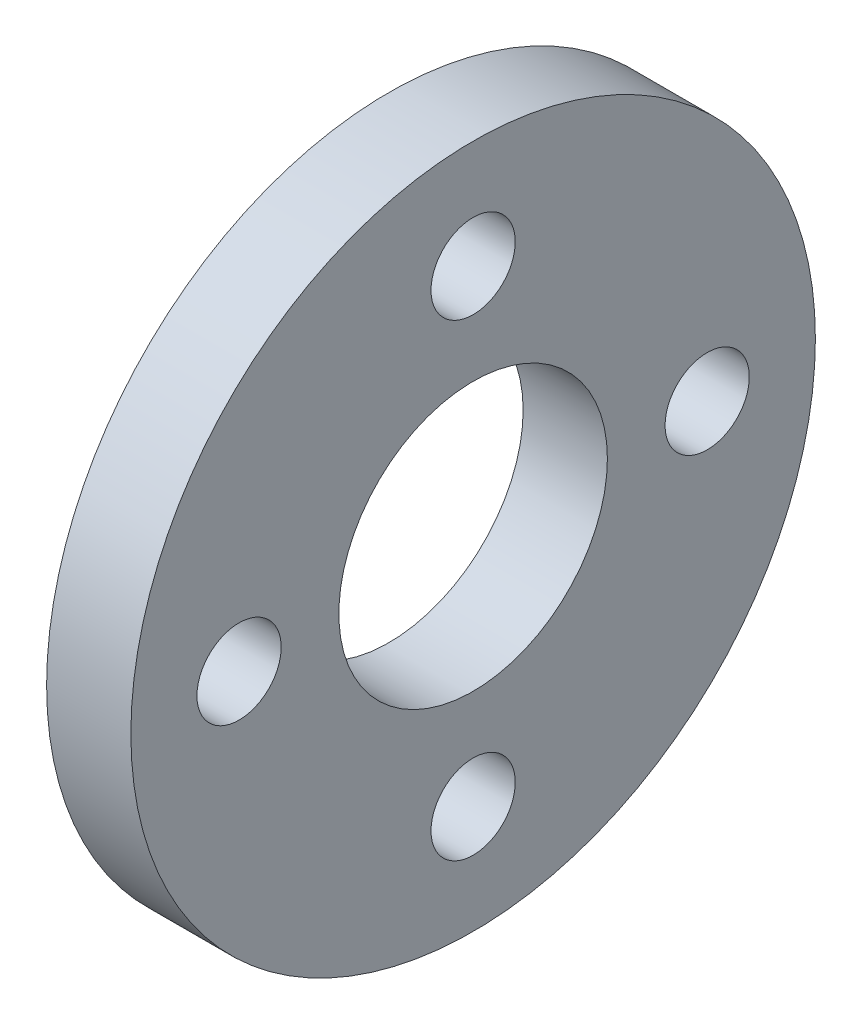
ISO-10303-21;
HEADER;
FILE_DESCRIPTION(('STEP AP214'),'2;1');
FILE_NAME('part.step','',(''),(''),'','','');
FILE_SCHEMA(('AUTOMOTIVE_DESIGN { 1 0 10303 214 1 1 1 1 }'));
ENDSEC;
DATA;
#1=APPLICATION_CONTEXT('core data for automotive mechanical design processes');
#2=APPLICATION_PROTOCOL_DEFINITION('international standard','automotive_design',2000,#1);
#3=PRODUCT_CONTEXT('',#1,'mechanical');
#4=PRODUCT('Part','Part','',(#3));
#5=PRODUCT_RELATED_PRODUCT_CATEGORY('part','',(#4));
#6=PRODUCT_DEFINITION_FORMATION('','',#4);
#7=PRODUCT_DEFINITION_CONTEXT('part definition',#1,'design');
#8=PRODUCT_DEFINITION('design','',#6,#7);
#9=PRODUCT_DEFINITION_SHAPE('','',#8);
#10=(LENGTH_UNIT() NAMED_UNIT(*) SI_UNIT(.MILLI.,.METRE.));
#11=(NAMED_UNIT(*) PLANE_ANGLE_UNIT() SI_UNIT($,.RADIAN.));
#12=(NAMED_UNIT(*) SI_UNIT($,.STERADIAN.) SOLID_ANGLE_UNIT());
#13=UNCERTAINTY_MEASURE_WITH_UNIT(LENGTH_MEASURE(1.E-05),#10,'distance_accuracy_value','');
#14=(GEOMETRIC_REPRESENTATION_CONTEXT(3) GLOBAL_UNCERTAINTY_ASSIGNED_CONTEXT((#13)) GLOBAL_UNIT_ASSIGNED_CONTEXT((#10,
#11,#12)) REPRESENTATION_CONTEXT('',''));
#15=CARTESIAN_POINT('',(0.,0.,0.));
#16=DIRECTION('',(0.,0.,1.));
#17=DIRECTION('',(1.,0.,0.));
#18=AXIS2_PLACEMENT_3D('',#15,#16,#17);
#19=CARTESIAN_POINT('',(16.,0.,44.45));
#20=DIRECTION('',(-1.,0.,0.));
#21=DIRECTION('',(0.,0.,1.));
#22=AXIS2_PLACEMENT_3D('',#19,#20,#21);
#23=CYLINDRICAL_SURFACE('',#22,8.);
#24=CARTESIAN_POINT('',(16.,0.,44.45));
#25=DIRECTION('',(-1.,0.,0.));
#26=DIRECTION('',(0.,0.,1.));
#27=AXIS2_PLACEMENT_3D('',#24,#25,#26);
#28=CIRCLE('',#27,8.);
#29=CARTESIAN_POINT('',(16.,0.,52.45));
#30=VERTEX_POINT('',#29);
#31=EDGE_CURVE('E39',#30,#30,#28,.T.);
#32=ORIENTED_EDGE('',*,*,#31,.F.);
#33=EDGE_LOOP('',(#32));
#34=FACE_BOUND('',#33,.T.);
#35=CARTESIAN_POINT('',(0.,0.,44.45));
#36=DIRECTION('',(-1.,0.,0.));
#37=DIRECTION('',(0.,0.,1.));
#38=AXIS2_PLACEMENT_3D('',#35,#36,#37);
#39=CIRCLE('',#38,8.);
#40=CARTESIAN_POINT('',(0.,0.,52.45));
#41=VERTEX_POINT('',#40);
#42=EDGE_CURVE('E16',#41,#41,#39,.F.);
#43=ORIENTED_EDGE('',*,*,#42,.F.);
#44=EDGE_LOOP('',(#43));
#45=FACE_BOUND('',#44,.T.);
#46=ADVANCED_FACE('F13',(#34,#45),#23,.F.);
#47=CARTESIAN_POINT('',(16.,-44.45,0.));
#48=DIRECTION('',(-1.,0.,0.));
#49=DIRECTION('',(0.,0.,1.));
#50=AXIS2_PLACEMENT_3D('',#47,#48,#49);
#51=CYLINDRICAL_SURFACE('',#50,8.);
#52=CARTESIAN_POINT('',(16.,-44.45,0.));
#53=DIRECTION('',(-1.,0.,0.));
#54=DIRECTION('',(0.,0.,1.));
#55=AXIS2_PLACEMENT_3D('',#52,#53,#54);
#56=CIRCLE('',#55,8.);
#57=CARTESIAN_POINT('',(16.,-44.45,8.00000000000001));
#58=VERTEX_POINT('',#57);
#59=EDGE_CURVE('E36',#58,#58,#56,.T.);
#60=ORIENTED_EDGE('',*,*,#59,.F.);
#61=EDGE_LOOP('',(#60));
#62=FACE_BOUND('',#61,.T.);
#63=CARTESIAN_POINT('',(0.,-44.45,0.));
#64=DIRECTION('',(-1.,0.,0.));
#65=DIRECTION('',(0.,0.,1.));
#66=AXIS2_PLACEMENT_3D('',#63,#64,#65);
#67=CIRCLE('',#66,8.);
#68=CARTESIAN_POINT('',(0.,-44.45,8.00000000000001));
#69=VERTEX_POINT('',#68);
#70=EDGE_CURVE('E50',#69,#69,#67,.F.);
#71=ORIENTED_EDGE('',*,*,#70,.F.);
#72=EDGE_LOOP('',(#71));
#73=FACE_BOUND('',#72,.T.);
#74=ADVANCED_FACE('F61',(#62,#73),#51,.F.);
#75=CARTESIAN_POINT('',(16.,0.,-44.45));
#76=DIRECTION('',(-1.,0.,0.));
#77=DIRECTION('',(0.,0.,1.));
#78=AXIS2_PLACEMENT_3D('',#75,#76,#77);
#79=CYLINDRICAL_SURFACE('',#78,8.);
#80=CARTESIAN_POINT('',(16.,0.,-44.45));
#81=DIRECTION('',(-1.,0.,0.));
#82=DIRECTION('',(0.,0.,1.));
#83=AXIS2_PLACEMENT_3D('',#80,#81,#82);
#84=CIRCLE('',#83,8.);
#85=CARTESIAN_POINT('',(16.,0.,-36.45));
#86=VERTEX_POINT('',#85);
#87=EDGE_CURVE('E33',#86,#86,#84,.T.);
#88=ORIENTED_EDGE('',*,*,#87,.F.);
#89=EDGE_LOOP('',(#88));
#90=FACE_BOUND('',#89,.T.);
#91=CARTESIAN_POINT('',(0.,0.,-44.45));
#92=DIRECTION('',(-1.,0.,0.));
#93=DIRECTION('',(0.,0.,1.));
#94=AXIS2_PLACEMENT_3D('',#91,#92,#93);
#95=CIRCLE('',#94,8.);
#96=CARTESIAN_POINT('',(0.,0.,-36.45));
#97=VERTEX_POINT('',#96);
#98=EDGE_CURVE('E48',#97,#97,#95,.F.);
#99=ORIENTED_EDGE('',*,*,#98,.F.);
#100=EDGE_LOOP('',(#99));
#101=FACE_BOUND('',#100,.T.);
#102=ADVANCED_FACE('F67',(#90,#101),#79,.F.);
#103=CARTESIAN_POINT('',(16.,44.45,0.));
#104=DIRECTION('',(-1.,0.,0.));
#105=DIRECTION('',(0.,0.,1.));
#106=AXIS2_PLACEMENT_3D('',#103,#104,#105);
#107=CYLINDRICAL_SURFACE('',#106,8.);
#108=CARTESIAN_POINT('',(16.,44.45,0.));
#109=DIRECTION('',(-1.,0.,0.));
#110=DIRECTION('',(0.,0.,1.));
#111=AXIS2_PLACEMENT_3D('',#108,#109,#110);
#112=CIRCLE('',#111,8.);
#113=CARTESIAN_POINT('',(16.,44.45,8.));
#114=VERTEX_POINT('',#113);
#115=EDGE_CURVE('E30',#114,#114,#112,.T.);
#116=ORIENTED_EDGE('',*,*,#115,.F.);
#117=EDGE_LOOP('',(#116));
#118=FACE_BOUND('',#117,.T.);
#119=CARTESIAN_POINT('',(0.,44.45,0.));
#120=DIRECTION('',(-1.,0.,0.));
#121=DIRECTION('',(0.,0.,1.));
#122=AXIS2_PLACEMENT_3D('',#119,#120,#121);
#123=CIRCLE('',#122,8.);
#124=CARTESIAN_POINT('',(0.,44.45,8.));
#125=VERTEX_POINT('',#124);
#126=EDGE_CURVE('E45',#125,#125,#123,.F.);
#127=ORIENTED_EDGE('',*,*,#126,.F.);
#128=EDGE_LOOP('',(#127));
#129=FACE_BOUND('',#128,.T.);
#130=ADVANCED_FACE('F87',(#118,#129),#107,.F.);
#131=CARTESIAN_POINT('',(0.,0.,0.));
#132=DIRECTION('',(1.,0.,0.));
#133=DIRECTION('',(0.,0.,-1.));
#134=AXIS2_PLACEMENT_3D('',#131,#132,#133);
#135=CYLINDRICAL_SURFACE('',#134,25.5);
#136=CARTESIAN_POINT('',(0.,0.,0.));
#137=DIRECTION('',(1.,0.,0.));
#138=DIRECTION('',(0.,0.,-1.));
#139=AXIS2_PLACEMENT_3D('',#136,#137,#138);
#140=CIRCLE('',#139,25.5);
#141=CARTESIAN_POINT('',(0.,0.,-25.5));
#142=VERTEX_POINT('',#141);
#143=EDGE_CURVE('E42',#142,#142,#140,.T.);
#144=ORIENTED_EDGE('',*,*,#143,.F.);
#145=EDGE_LOOP('',(#144));
#146=FACE_BOUND('',#145,.T.);
#147=CARTESIAN_POINT('',(16.,0.,0.));
#148=DIRECTION('',(1.,0.,0.));
#149=DIRECTION('',(0.,0.,-1.));
#150=AXIS2_PLACEMENT_3D('',#147,#148,#149);
#151=CIRCLE('',#150,25.5);
#152=CARTESIAN_POINT('',(16.,0.,-25.5));
#153=VERTEX_POINT('',#152);
#154=EDGE_CURVE('E25',#153,#153,#151,.F.);
#155=ORIENTED_EDGE('',*,*,#154,.F.);
#156=EDGE_LOOP('',(#155));
#157=FACE_BOUND('',#156,.T.);
#158=ADVANCED_FACE('F83',(#146,#157),#135,.F.);
#159=CARTESIAN_POINT('',(0.,-65.7800021085076,-65.));
#160=DIRECTION('',(-1.,0.,0.));
#161=DIRECTION('',(0.,0.,1.));
#162=AXIS2_PLACEMENT_3D('',#159,#160,#161);
#163=PLANE('',#162);
#164=ORIENTED_EDGE('',*,*,#143,.T.);
#165=EDGE_LOOP('',(#164));
#166=FACE_BOUND('',#165,.T.);
#167=ORIENTED_EDGE('',*,*,#126,.T.);
#168=EDGE_LOOP('',(#167));
#169=FACE_BOUND('',#168,.T.);
#170=ORIENTED_EDGE('',*,*,#98,.T.);
#171=EDGE_LOOP('',(#170));
#172=FACE_BOUND('',#171,.T.);
#173=ORIENTED_EDGE('',*,*,#70,.T.);
#174=EDGE_LOOP('',(#173));
#175=FACE_BOUND('',#174,.T.);
#176=ORIENTED_EDGE('',*,*,#42,.T.);
#177=EDGE_LOOP('',(#176));
#178=FACE_BOUND('',#177,.T.);
#179=CARTESIAN_POINT('',(0.,0.,0.));
#180=DIRECTION('',(1.,0.,0.));
#181=DIRECTION('',(0.,0.,-1.));
#182=AXIS2_PLACEMENT_3D('',#179,#180,#181);
#183=CIRCLE('',#182,65.);
#184=CARTESIAN_POINT('',(0.,0.,-65.));
#185=VERTEX_POINT('',#184);
#186=EDGE_CURVE('E20',#185,#185,#183,.T.);
#187=ORIENTED_EDGE('',*,*,#186,.F.);
#188=EDGE_LOOP('',(#187));
#189=FACE_BOUND('',#188,.T.);
#190=ADVANCED_FACE('F57',(#166,#169,#172,#175,#178,#189),#163,.T.);
#191=CARTESIAN_POINT('',(16.,-65.7800021085076,65.));
#192=DIRECTION('',(1.,0.,0.));
#193=DIRECTION('',(0.,0.,-1.));
#194=AXIS2_PLACEMENT_3D('',#191,#192,#193);
#195=PLANE('',#194);
#196=ORIENTED_EDGE('',*,*,#154,.T.);
#197=EDGE_LOOP('',(#196));
#198=FACE_BOUND('',#197,.T.);
#199=ORIENTED_EDGE('',*,*,#115,.T.);
#200=EDGE_LOOP('',(#199));
#201=FACE_BOUND('',#200,.T.);
#202=ORIENTED_EDGE('',*,*,#87,.T.);
#203=EDGE_LOOP('',(#202));
#204=FACE_BOUND('',#203,.T.);
#205=ORIENTED_EDGE('',*,*,#59,.T.);
#206=EDGE_LOOP('',(#205));
#207=FACE_BOUND('',#206,.T.);
#208=ORIENTED_EDGE('',*,*,#31,.T.);
#209=EDGE_LOOP('',(#208));
#210=FACE_BOUND('',#209,.T.);
#211=CARTESIAN_POINT('',(16.,0.,0.));
#212=DIRECTION('',(1.,0.,0.));
#213=DIRECTION('',(0.,0.,-1.));
#214=AXIS2_PLACEMENT_3D('',#211,#212,#213);
#215=CIRCLE('',#214,65.);
#216=CARTESIAN_POINT('',(16.,0.,-65.));
#217=VERTEX_POINT('',#216);
#218=EDGE_CURVE('E8',#217,#217,#215,.F.);
#219=ORIENTED_EDGE('',*,*,#218,.F.);
#220=EDGE_LOOP('',(#219));
#221=FACE_BOUND('',#220,.T.);
#222=ADVANCED_FACE('F72',(#198,#201,#204,#207,#210,#221),#195,.T.);
#223=CARTESIAN_POINT('',(16.,0.,0.));
#224=DIRECTION('',(1.,0.,0.));
#225=DIRECTION('',(0.,0.,-1.));
#226=AXIS2_PLACEMENT_3D('',#223,#224,#225);
#227=CYLINDRICAL_SURFACE('',#226,65.);
#228=ORIENTED_EDGE('',*,*,#186,.T.);
#229=EDGE_LOOP('',(#228));
#230=FACE_BOUND('',#229,.T.);
#231=ORIENTED_EDGE('',*,*,#218,.T.);
#232=EDGE_LOOP('',(#231));
#233=FACE_BOUND('',#232,.T.);
#234=ADVANCED_FACE('F70',(#230,#233),#227,.T.);
#235=CLOSED_SHELL('',(#46,#74,#102,#130,#158,#190,#222,#234));
#236=MANIFOLD_SOLID_BREP('B1',#235);
#237=ADVANCED_BREP_SHAPE_REPRESENTATION('',(#18,#236),#14);
#238=SHAPE_DEFINITION_REPRESENTATION(#9,#237);
ENDSEC;
END-ISO-10303-21;
